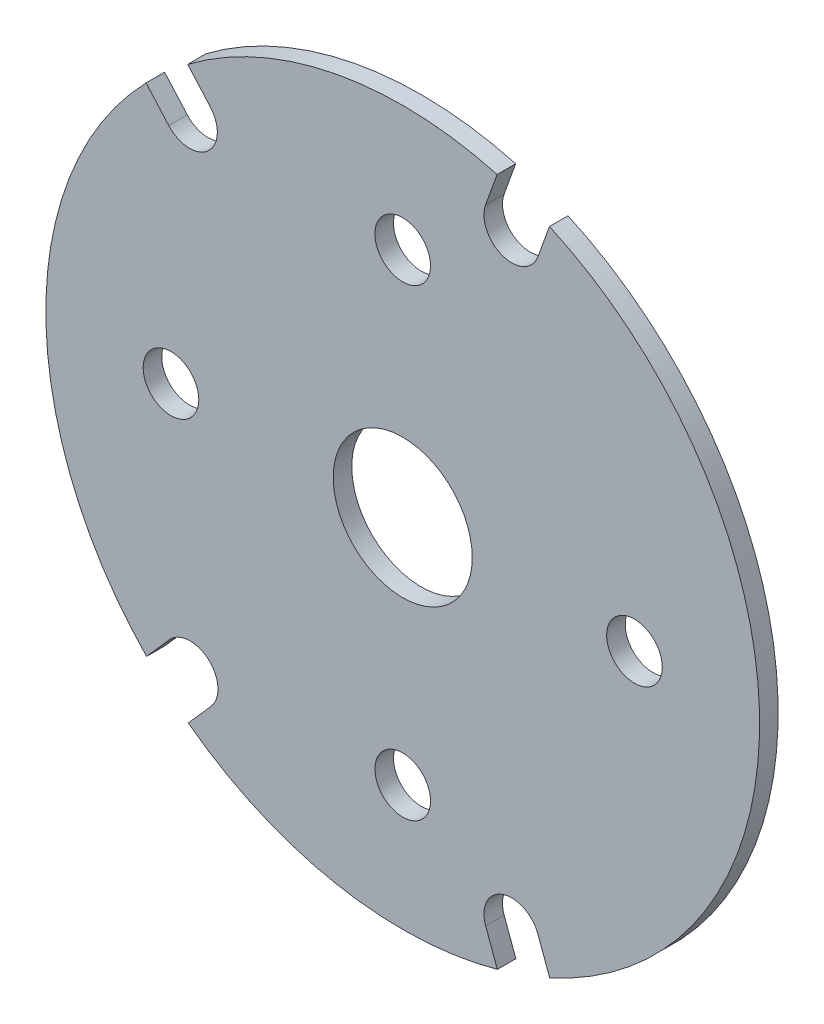
ISO-10303-21;
HEADER;
FILE_DESCRIPTION(('STEP AP214'),'2;1');
FILE_NAME('part.step','',(''),(''),'','','');
FILE_SCHEMA(('AUTOMOTIVE_DESIGN { 1 0 10303 214 1 1 1 1 }'));
ENDSEC;
DATA;
#1=APPLICATION_CONTEXT('core data for automotive mechanical design processes');
#2=APPLICATION_PROTOCOL_DEFINITION('international standard','automotive_design',2000,#1);
#3=PRODUCT_CONTEXT('',#1,'mechanical');
#4=PRODUCT('Part','Part','',(#3));
#5=PRODUCT_RELATED_PRODUCT_CATEGORY('part','',(#4));
#6=PRODUCT_DEFINITION_FORMATION('','',#4);
#7=PRODUCT_DEFINITION_CONTEXT('part definition',#1,'design');
#8=PRODUCT_DEFINITION('design','',#6,#7);
#9=PRODUCT_DEFINITION_SHAPE('','',#8);
#10=(LENGTH_UNIT() NAMED_UNIT(*) SI_UNIT(.MILLI.,.METRE.));
#11=(NAMED_UNIT(*) PLANE_ANGLE_UNIT() SI_UNIT($,.RADIAN.));
#12=(NAMED_UNIT(*) SI_UNIT($,.STERADIAN.) SOLID_ANGLE_UNIT());
#13=UNCERTAINTY_MEASURE_WITH_UNIT(LENGTH_MEASURE(1.E-05),#10,'distance_accuracy_value','');
#14=(GEOMETRIC_REPRESENTATION_CONTEXT(3) GLOBAL_UNCERTAINTY_ASSIGNED_CONTEXT((#13)) GLOBAL_UNIT_ASSIGNED_CONTEXT((#10,
#11,#12)) REPRESENTATION_CONTEXT('',''));
#15=CARTESIAN_POINT('',(0.,0.,0.));
#16=DIRECTION('',(0.,0.,1.));
#17=DIRECTION('',(1.,0.,0.));
#18=AXIS2_PLACEMENT_3D('',#15,#16,#17);
#19=CARTESIAN_POINT('',(0.,0.,2.));
#20=DIRECTION('',(0.,0.,-1.));
#21=DIRECTION('',(-1.,0.,0.));
#22=AXIS2_PLACEMENT_3D('',#19,#20,#21);
#23=PLANE('',#22);
#24=CARTESIAN_POINT('',(0.,-24.9999999999999,2.));
#25=DIRECTION('',(0.,0.,1.));
#26=DIRECTION('',(1.,0.,0.));
#27=AXIS2_PLACEMENT_3D('',#24,#25,#26);
#28=CIRCLE('',#27,3.00000000000011);
#29=CARTESIAN_POINT('',(3.00000000000011,-24.9999999999999,2.));
#30=VERTEX_POINT('',#29);
#31=EDGE_CURVE('E348',#30,#30,#28,.T.);
#32=ORIENTED_EDGE('',*,*,#31,.F.);
#33=EDGE_LOOP('',(#32));
#34=FACE_BOUND('',#33,.T.);
#35=CARTESIAN_POINT('',(0.,25.0000000000001,2.));
#36=DIRECTION('',(0.,0.,1.));
#37=DIRECTION('',(1.,0.,0.));
#38=AXIS2_PLACEMENT_3D('',#35,#36,#37);
#39=CIRCLE('',#38,3.00000000000011);
#40=CARTESIAN_POINT('',(3.00000000000011,25.0000000000001,2.));
#41=VERTEX_POINT('',#40);
#42=EDGE_CURVE('E360',#41,#41,#39,.T.);
#43=ORIENTED_EDGE('',*,*,#42,.F.);
#44=EDGE_LOOP('',(#43));
#45=FACE_BOUND('',#44,.T.);
#46=CARTESIAN_POINT('',(0.,0.,2.));
#47=DIRECTION('',(0.,0.,1.));
#48=DIRECTION('',(-1.,0.,0.));
#49=AXIS2_PLACEMENT_3D('',#46,#47,#48);
#50=CIRCLE('',#49,38.5000000000001);
#51=CARTESIAN_POINT('',(10.1824279789369,37.1290743279949,2.));
#52=VERTEX_POINT('',#51);
#53=CARTESIAN_POINT('',(-23.1958325761252,30.7278920705664,2.));
#54=VERTEX_POINT('',#53);
#55=EDGE_CURVE('E209',#52,#54,#50,.T.);
#56=ORIENTED_EDGE('',*,*,#55,.T.);
#57=DIRECTION('',(0.662848980359993,-0.748753116344579,0.));
#58=VECTOR('',#57,1.);
#59=CARTESIAN_POINT('',(-23.1958325761252,30.7278920705664,2.));
#60=LINE('',#59,#58);
#61=CARTESIAN_POINT('',(-20.7537406509652,27.9693090546125,2.));
#62=VERTEX_POINT('',#61);
#63=EDGE_CURVE('E117',#54,#62,#60,.T.);
#64=ORIENTED_EDGE('',*,*,#63,.T.);
#65=CARTESIAN_POINT('',(-22.999999999999,25.9807621135325,2.));
#66=DIRECTION('',(0.,0.,-1.));
#67=DIRECTION('',(1.,0.,0.));
#68=AXIS2_PLACEMENT_3D('',#65,#66,#67);
#69=CIRCLE('',#68,3.00000000000011);
#70=CARTESIAN_POINT('',(-25.2462593490335,23.9922151724532,2.));
#71=VERTEX_POINT('',#70);
#72=EDGE_CURVE('E248',#62,#71,#69,.T.);
#73=ORIENTED_EDGE('',*,*,#72,.T.);
#74=DIRECTION('',(-0.662848980359739,0.748753116344803,0.));
#75=VECTOR('',#74,1.);
#76=CARTESIAN_POINT('',(-27.6883512741925,26.7507981884079,2.));
#77=LINE('',#76,#75);
#78=CARTESIAN_POINT('',(-27.6883512741925,26.7507981884079,2.));
#79=VERTEX_POINT('',#78);
#80=EDGE_CURVE('E267',#71,#79,#77,.T.);
#81=ORIENTED_EDGE('',*,*,#80,.T.);
#82=CARTESIAN_POINT('',(0.,0.,2.));
#83=DIRECTION('',(0.,0.,1.));
#84=DIRECTION('',(1.,0.,0.));
#85=AXIS2_PLACEMENT_3D('',#82,#83,#84);
#86=CIRCLE('',#85,38.5000000000001);
#87=CARTESIAN_POINT('',(-27.6356502480301,-26.8052389537673,2.));
#88=VERTEX_POINT('',#87);
#89=EDGE_CURVE('E264',#79,#88,#86,.T.);
#90=ORIENTED_EDGE('',*,*,#89,.T.);
#91=DIRECTION('',(0.661374099223748,0.750056198478471,0.));
#92=VECTOR('',#91,1.);
#93=CARTESIAN_POINT('',(-27.6356502480301,-26.8052389537673,2.));
#94=LINE('',#93,#92);
#95=CARTESIAN_POINT('',(-25.1818791704052,-24.0224474767805,2.));
#96=VERTEX_POINT('',#95);
#97=EDGE_CURVE('E266',#88,#96,#94,.T.);
#98=ORIENTED_EDGE('',*,*,#97,.T.);
#99=CARTESIAN_POINT('',(-22.9317105749697,-26.0065697744518,2.));
#100=DIRECTION('',(0.,0.,-1.));
#101=DIRECTION('',(1.,0.,0.));
#102=AXIS2_PLACEMENT_3D('',#99,#100,#101);
#103=CIRCLE('',#102,3.00000000000011);
#104=CARTESIAN_POINT('',(-20.6815419795334,-27.9906920721221,2.));
#105=VERTEX_POINT('',#104);
#106=EDGE_CURVE('E269',#96,#105,#103,.T.);
#107=ORIENTED_EDGE('',*,*,#106,.T.);
#108=DIRECTION('',(-0.661374099223434,-0.750056198478749,0.));
#109=VECTOR('',#108,1.);
#110=CARTESIAN_POINT('',(-23.1353130571571,-30.77348354911,2.));
#111=LINE('',#110,#109);
#112=CARTESIAN_POINT('',(-23.1353130571571,-30.77348354911,2.));
#113=VERTEX_POINT('',#112);
#114=EDGE_CURVE('E275',#105,#113,#111,.T.);
#115=ORIENTED_EDGE('',*,*,#114,.T.);
#116=CARTESIAN_POINT('',(0.,0.,2.));
#117=DIRECTION('',(0.,0.,1.));
#118=DIRECTION('',(1.,0.,0.));
#119=AXIS2_PLACEMENT_3D('',#116,#117,#118);
#120=CIRCLE('',#119,38.5000000000001);
#121=CARTESIAN_POINT('',(10.2065672611284,-37.1224458346169,2.));
#122=VERTEX_POINT('',#121);
#123=EDGE_CURVE('E277',#113,#122,#120,.T.);
#124=ORIENTED_EDGE('',*,*,#123,.T.);
#125=DIRECTION('',(-0.345205371147535,0.938527171546404,0.));
#126=VECTOR('',#125,1.);
#127=CARTESIAN_POINT('',(8.94677793861724,-33.697393363184,2.));
#128=LINE('',#127,#126);
#129=CARTESIAN_POINT('',(8.94677793861724,-33.697393363184,2.));
#130=VERTEX_POINT('',#129);
#131=EDGE_CURVE('E279',#122,#130,#128,.T.);
#132=ORIENTED_EDGE('',*,*,#131,.T.);
#133=CARTESIAN_POINT('',(11.7623155639084,-32.6617933929489,2.));
#134=DIRECTION('',(0.,0.,-1.));
#135=DIRECTION('',(1.,0.,0.));
#136=AXIS2_PLACEMENT_3D('',#133,#134,#135);
#137=CIRCLE('',#136,2.99995323593236);
#138=CARTESIAN_POINT('',(14.5778531891995,-31.6261934227138,2.));
#139=VERTEX_POINT('',#138);
#140=EDGE_CURVE('E281',#130,#139,#137,.T.);
#141=ORIENTED_EDGE('',*,*,#140,.T.);
#142=DIRECTION('',(0.345205371147454,-0.938527171546434,0.));
#143=VECTOR('',#142,1.);
#144=CARTESIAN_POINT('',(14.5778531891995,-31.6261934227138,2.));
#145=LINE('',#144,#143);
#146=CARTESIAN_POINT('',(15.8503654511488,-35.0858363882784,2.));
#147=VERTEX_POINT('',#146);
#148=EDGE_CURVE('E283',#139,#147,#145,.T.);
#149=ORIENTED_EDGE('',*,*,#148,.T.);
#150=CARTESIAN_POINT('',(0.,0.,2.));
#151=DIRECTION('',(0.,0.,1.));
#152=DIRECTION('',(1.,0.,0.));
#153=AXIS2_PLACEMENT_3D('',#150,#151,#152);
#154=CIRCLE('',#153,38.5000000000001);
#155=CARTESIAN_POINT('',(15.8274456798914,35.0961816049851,2.));
#156=VERTEX_POINT('',#155);
#157=EDGE_CURVE('E160',#147,#156,#154,.T.);
#158=ORIENTED_EDGE('',*,*,#157,.T.);
#159=DIRECTION('',(-0.338820735357716,-0.940850949561968,0.));
#160=VECTOR('',#159,1.);
#161=CARTESIAN_POINT('',(14.5848244145768,31.6456212483918,2.));
#162=LINE('',#161,#160);
#163=CARTESIAN_POINT('',(14.5848244145768,31.6456212483918,2.));
#164=VERTEX_POINT('',#163);
#165=EDGE_CURVE('E154',#156,#164,#162,.T.);
#166=ORIENTED_EDGE('',*,*,#165,.T.);
#167=CARTESIAN_POINT('',(11.7623155639084,32.6620676098292,2.));
#168=DIRECTION('',(0.,0.,-1.));
#169=DIRECTION('',(1.,0.,0.));
#170=AXIS2_PLACEMENT_3D('',#167,#168,#169);
#171=CIRCLE('',#170,2.99995323593236);
#172=CARTESIAN_POINT('',(8.93980671332687,33.678513971508,2.));
#173=VERTEX_POINT('',#172);
#174=EDGE_CURVE('E158',#164,#173,#171,.T.);
#175=ORIENTED_EDGE('',*,*,#174,.T.);
#176=DIRECTION('',(0.338820735438274,0.940850949532957,0.));
#177=VECTOR('',#176,1.);
#178=CARTESIAN_POINT('',(8.93980671332687,33.678513971508,2.));
#179=LINE('',#178,#177);
#180=EDGE_CURVE('E50',#173,#52,#179,.T.);
#181=ORIENTED_EDGE('',*,*,#180,.T.);
#182=EDGE_LOOP('',(#56,#64,#73,#81,#90,#98,#107,#115,#124,#132,#141,#149,#158,#166,#175,#181));
#183=FACE_BOUND('',#182,.T.);
#184=CARTESIAN_POINT('',(0.,0.,2.));
#185=DIRECTION('',(0.,0.,1.));
#186=DIRECTION('',(1.,0.,0.));
#187=AXIS2_PLACEMENT_3D('',#184,#185,#186);
#188=CIRCLE('',#187,7.49999999999984);
#189=CARTESIAN_POINT('',(7.49999999999984,0.,2.));
#190=VERTEX_POINT('',#189);
#191=EDGE_CURVE('E182',#190,#190,#188,.T.);
#192=ORIENTED_EDGE('',*,*,#191,.F.);
#193=EDGE_LOOP('',(#192));
#194=FACE_BOUND('',#193,.T.);
#195=CARTESIAN_POINT('',(25.0000000000004,0.,2.));
#196=DIRECTION('',(0.,0.,1.));
#197=DIRECTION('',(1.,0.,0.));
#198=AXIS2_PLACEMENT_3D('',#195,#196,#197);
#199=CIRCLE('',#198,3.00000000000011);
#200=CARTESIAN_POINT('',(28.0000000000005,0.,2.));
#201=VERTEX_POINT('',#200);
#202=EDGE_CURVE('E354',#201,#201,#199,.T.);
#203=ORIENTED_EDGE('',*,*,#202,.F.);
#204=EDGE_LOOP('',(#203));
#205=FACE_BOUND('',#204,.T.);
#206=CARTESIAN_POINT('',(-24.9999999999999,-1.11022302462516E-13,2.));
#207=DIRECTION('',(0.,0.,1.));
#208=DIRECTION('',(1.,0.,0.));
#209=AXIS2_PLACEMENT_3D('',#206,#207,#208);
#210=CIRCLE('',#209,3.00000000000014);
#211=CARTESIAN_POINT('',(-21.9999999999998,-1.11022302462516E-13,2.));
#212=VERTEX_POINT('',#211);
#213=EDGE_CURVE('E339',#212,#212,#210,.T.);
#214=ORIENTED_EDGE('',*,*,#213,.F.);
#215=EDGE_LOOP('',(#214));
#216=FACE_BOUND('',#215,.T.);
#217=ADVANCED_FACE('F33',(#34,#45,#183,#194,#205,#216),#23,.F.);
#218=CARTESIAN_POINT('',(0.,0.,0.));
#219=DIRECTION('',(0.,0.,-1.));
#220=DIRECTION('',(-1.,0.,0.));
#221=AXIS2_PLACEMENT_3D('',#218,#219,#220);
#222=PLANE('',#221);
#223=CARTESIAN_POINT('',(0.,-24.9999999999999,0.));
#224=DIRECTION('',(0.,0.,1.));
#225=DIRECTION('',(1.,0.,0.));
#226=AXIS2_PLACEMENT_3D('',#223,#224,#225);
#227=CIRCLE('',#226,3.00000000000011);
#228=CARTESIAN_POINT('',(3.00000000000011,-24.9999999999999,0.));
#229=VERTEX_POINT('',#228);
#230=EDGE_CURVE('E345',#229,#229,#227,.T.);
#231=ORIENTED_EDGE('',*,*,#230,.T.);
#232=EDGE_LOOP('',(#231));
#233=FACE_BOUND('',#232,.T.);
#234=CARTESIAN_POINT('',(0.,25.0000000000001,0.));
#235=DIRECTION('',(0.,0.,1.));
#236=DIRECTION('',(1.,0.,0.));
#237=AXIS2_PLACEMENT_3D('',#234,#235,#236);
#238=CIRCLE('',#237,3.00000000000011);
#239=CARTESIAN_POINT('',(3.00000000000011,25.0000000000001,0.));
#240=VERTEX_POINT('',#239);
#241=EDGE_CURVE('E357',#240,#240,#238,.T.);
#242=ORIENTED_EDGE('',*,*,#241,.T.);
#243=EDGE_LOOP('',(#242));
#244=FACE_BOUND('',#243,.T.);
#245=CARTESIAN_POINT('',(0.,0.,0.));
#246=DIRECTION('',(0.,0.,1.));
#247=DIRECTION('',(-1.,0.,0.));
#248=AXIS2_PLACEMENT_3D('',#245,#246,#247);
#249=CIRCLE('',#248,38.5000000000001);
#250=CARTESIAN_POINT('',(10.1824279789369,37.1290743279949,0.));
#251=VERTEX_POINT('',#250);
#252=CARTESIAN_POINT('',(-23.1958325761252,30.7278920705664,0.));
#253=VERTEX_POINT('',#252);
#254=EDGE_CURVE('E178',#251,#253,#249,.T.);
#255=ORIENTED_EDGE('',*,*,#254,.F.);
#256=DIRECTION('',(0.338820735438274,0.940850949532957,0.));
#257=VECTOR('',#256,1.);
#258=CARTESIAN_POINT('',(8.93980671332687,33.678513971508,0.));
#259=LINE('',#258,#257);
#260=CARTESIAN_POINT('',(8.93980671332687,33.678513971508,0.));
#261=VERTEX_POINT('',#260);
#262=EDGE_CURVE('E109',#261,#251,#259,.T.);
#263=ORIENTED_EDGE('',*,*,#262,.F.);
#264=CARTESIAN_POINT('',(11.7623155639084,32.6620676098292,0.));
#265=DIRECTION('',(0.,0.,-1.));
#266=DIRECTION('',(1.,0.,0.));
#267=AXIS2_PLACEMENT_3D('',#264,#265,#266);
#268=CIRCLE('',#267,2.99995323593236);
#269=CARTESIAN_POINT('',(14.5848244145768,31.6456212483918,0.));
#270=VERTEX_POINT('',#269);
#271=EDGE_CURVE('E103',#270,#261,#268,.T.);
#272=ORIENTED_EDGE('',*,*,#271,.F.);
#273=DIRECTION('',(-0.338820735357716,-0.940850949561968,0.));
#274=VECTOR('',#273,1.);
#275=CARTESIAN_POINT('',(14.5848244145768,31.6456212483918,0.));
#276=LINE('',#275,#274);
#277=CARTESIAN_POINT('',(15.8274456798914,35.0961816049851,0.));
#278=VERTEX_POINT('',#277);
#279=EDGE_CURVE('E168',#278,#270,#276,.T.);
#280=ORIENTED_EDGE('',*,*,#279,.F.);
#281=CARTESIAN_POINT('',(0.,0.,0.));
#282=DIRECTION('',(0.,0.,1.));
#283=DIRECTION('',(1.,0.,0.));
#284=AXIS2_PLACEMENT_3D('',#281,#282,#283);
#285=CIRCLE('',#284,38.5000000000001);
#286=CARTESIAN_POINT('',(15.8503654511488,-35.0858363882784,0.));
#287=VERTEX_POINT('',#286);
#288=EDGE_CURVE('E204',#287,#278,#285,.T.);
#289=ORIENTED_EDGE('',*,*,#288,.F.);
#290=DIRECTION('',(0.345205371147454,-0.938527171546434,0.));
#291=VECTOR('',#290,1.);
#292=CARTESIAN_POINT('',(14.5778531891995,-31.6261934227138,0.));
#293=LINE('',#292,#291);
#294=CARTESIAN_POINT('',(14.5778531891995,-31.6261934227138,0.));
#295=VERTEX_POINT('',#294);
#296=EDGE_CURVE('E202',#295,#287,#293,.T.);
#297=ORIENTED_EDGE('',*,*,#296,.F.);
#298=CARTESIAN_POINT('',(11.7623155639084,-32.6617933929489,0.));
#299=DIRECTION('',(0.,0.,-1.));
#300=DIRECTION('',(1.,0.,0.));
#301=AXIS2_PLACEMENT_3D('',#298,#299,#300);
#302=CIRCLE('',#301,2.99995323593236);
#303=CARTESIAN_POINT('',(8.94677793861724,-33.697393363184,0.));
#304=VERTEX_POINT('',#303);
#305=EDGE_CURVE('E200',#304,#295,#302,.T.);
#306=ORIENTED_EDGE('',*,*,#305,.F.);
#307=DIRECTION('',(-0.345205371147535,0.938527171546404,0.));
#308=VECTOR('',#307,1.);
#309=CARTESIAN_POINT('',(8.94677793861724,-33.697393363184,0.));
#310=LINE('',#309,#308);
#311=CARTESIAN_POINT('',(10.2065672611284,-37.1224458346169,0.));
#312=VERTEX_POINT('',#311);
#313=EDGE_CURVE('E198',#312,#304,#310,.T.);
#314=ORIENTED_EDGE('',*,*,#313,.F.);
#315=CARTESIAN_POINT('',(0.,0.,0.));
#316=DIRECTION('',(0.,0.,1.));
#317=DIRECTION('',(1.,0.,0.));
#318=AXIS2_PLACEMENT_3D('',#315,#316,#317);
#319=CIRCLE('',#318,38.5000000000001);
#320=CARTESIAN_POINT('',(-23.1353130571571,-30.77348354911,0.));
#321=VERTEX_POINT('',#320);
#322=EDGE_CURVE('E196',#321,#312,#319,.T.);
#323=ORIENTED_EDGE('',*,*,#322,.F.);
#324=DIRECTION('',(-0.661374099223434,-0.750056198478749,0.));
#325=VECTOR('',#324,1.);
#326=CARTESIAN_POINT('',(-23.1353130571571,-30.77348354911,0.));
#327=LINE('',#326,#325);
#328=CARTESIAN_POINT('',(-20.6815419795334,-27.9906920721221,0.));
#329=VERTEX_POINT('',#328);
#330=EDGE_CURVE('E194',#329,#321,#327,.T.);
#331=ORIENTED_EDGE('',*,*,#330,.F.);
#332=CARTESIAN_POINT('',(-22.9317105749697,-26.0065697744518,0.));
#333=DIRECTION('',(0.,0.,-1.));
#334=DIRECTION('',(1.,0.,0.));
#335=AXIS2_PLACEMENT_3D('',#332,#333,#334);
#336=CIRCLE('',#335,3.00000000000011);
#337=CARTESIAN_POINT('',(-25.1818791704052,-24.0224474767805,0.));
#338=VERTEX_POINT('',#337);
#339=EDGE_CURVE('E192',#338,#329,#336,.T.);
#340=ORIENTED_EDGE('',*,*,#339,.F.);
#341=DIRECTION('',(0.661374099223748,0.750056198478471,0.));
#342=VECTOR('',#341,1.);
#343=CARTESIAN_POINT('',(-27.6356502480301,-26.8052389537673,0.));
#344=LINE('',#343,#342);
#345=CARTESIAN_POINT('',(-27.6356502480301,-26.8052389537673,0.));
#346=VERTEX_POINT('',#345);
#347=EDGE_CURVE('E190',#346,#338,#344,.T.);
#348=ORIENTED_EDGE('',*,*,#347,.F.);
#349=CARTESIAN_POINT('',(0.,0.,0.));
#350=DIRECTION('',(0.,0.,1.));
#351=DIRECTION('',(1.,0.,0.));
#352=AXIS2_PLACEMENT_3D('',#349,#350,#351);
#353=CIRCLE('',#352,38.5000000000001);
#354=CARTESIAN_POINT('',(-27.6883512741925,26.7507981884079,0.));
#355=VERTEX_POINT('',#354);
#356=EDGE_CURVE('E188',#355,#346,#353,.T.);
#357=ORIENTED_EDGE('',*,*,#356,.F.);
#358=DIRECTION('',(-0.662848980359739,0.748753116344803,0.));
#359=VECTOR('',#358,1.);
#360=CARTESIAN_POINT('',(-27.6883512741925,26.7507981884079,0.));
#361=LINE('',#360,#359);
#362=CARTESIAN_POINT('',(-25.2462593490335,23.9922151724532,0.));
#363=VERTEX_POINT('',#362);
#364=EDGE_CURVE('E186',#363,#355,#361,.T.);
#365=ORIENTED_EDGE('',*,*,#364,.F.);
#366=CARTESIAN_POINT('',(-22.999999999999,25.9807621135325,0.));
#367=DIRECTION('',(0.,0.,-1.));
#368=DIRECTION('',(1.,0.,0.));
#369=AXIS2_PLACEMENT_3D('',#366,#367,#368);
#370=CIRCLE('',#369,3.00000000000011);
#371=CARTESIAN_POINT('',(-20.7537406509652,27.9693090546125,0.));
#372=VERTEX_POINT('',#371);
#373=EDGE_CURVE('E184',#372,#363,#370,.T.);
#374=ORIENTED_EDGE('',*,*,#373,.F.);
#375=DIRECTION('',(0.662848980359993,-0.748753116344579,0.));
#376=VECTOR('',#375,1.);
#377=CARTESIAN_POINT('',(-23.1958325761252,30.7278920705664,0.));
#378=LINE('',#377,#376);
#379=EDGE_CURVE('E181',#253,#372,#378,.T.);
#380=ORIENTED_EDGE('',*,*,#379,.F.);
#381=EDGE_LOOP('',(#255,#263,#272,#280,#289,#297,#306,#314,#323,#331,#340,#348,#357,#365,#374,#380));
#382=FACE_BOUND('',#381,.T.);
#383=CARTESIAN_POINT('',(0.,0.,0.));
#384=DIRECTION('',(0.,0.,1.));
#385=DIRECTION('',(1.,0.,0.));
#386=AXIS2_PLACEMENT_3D('',#383,#384,#385);
#387=CIRCLE('',#386,7.49999999999984);
#388=CARTESIAN_POINT('',(7.49999999999984,0.,0.));
#389=VERTEX_POINT('',#388);
#390=EDGE_CURVE('E363',#389,#389,#387,.T.);
#391=ORIENTED_EDGE('',*,*,#390,.T.);
#392=EDGE_LOOP('',(#391));
#393=FACE_BOUND('',#392,.T.);
#394=CARTESIAN_POINT('',(25.0000000000004,0.,0.));
#395=DIRECTION('',(0.,0.,1.));
#396=DIRECTION('',(1.,0.,0.));
#397=AXIS2_PLACEMENT_3D('',#394,#395,#396);
#398=CIRCLE('',#397,3.00000000000011);
#399=CARTESIAN_POINT('',(28.0000000000005,0.,0.));
#400=VERTEX_POINT('',#399);
#401=EDGE_CURVE('E351',#400,#400,#398,.T.);
#402=ORIENTED_EDGE('',*,*,#401,.T.);
#403=EDGE_LOOP('',(#402));
#404=FACE_BOUND('',#403,.T.);
#405=CARTESIAN_POINT('',(-24.9999999999999,-1.11022302462516E-13,0.));
#406=DIRECTION('',(0.,0.,1.));
#407=DIRECTION('',(1.,0.,0.));
#408=AXIS2_PLACEMENT_3D('',#405,#406,#407);
#409=CIRCLE('',#408,3.00000000000014);
#410=CARTESIAN_POINT('',(-21.9999999999998,-1.11022302462516E-13,0.));
#411=VERTEX_POINT('',#410);
#412=EDGE_CURVE('E342',#411,#411,#409,.T.);
#413=ORIENTED_EDGE('',*,*,#412,.T.);
#414=EDGE_LOOP('',(#413));
#415=FACE_BOUND('',#414,.T.);
#416=ADVANCED_FACE('F252',(#233,#244,#382,#393,#404,#415),#222,.T.);
#417=CARTESIAN_POINT('',(0.,0.,2.));
#418=DIRECTION('',(0.,0.,-1.));
#419=DIRECTION('',(-1.,0.,0.));
#420=AXIS2_PLACEMENT_3D('',#417,#418,#419);
#421=CYLINDRICAL_SURFACE('',#420,38.5000000000001);
#422=ORIENTED_EDGE('',*,*,#254,.T.);
#423=DIRECTION('',(0.,0.,-1.));
#424=VECTOR('',#423,1.);
#425=CARTESIAN_POINT('',(-23.1958325761252,30.7278920705664,2.));
#426=LINE('',#425,#424);
#427=EDGE_CURVE('E11',#54,#253,#426,.T.);
#428=ORIENTED_EDGE('',*,*,#427,.F.);
#429=ORIENTED_EDGE('',*,*,#55,.F.);
#430=DIRECTION('',(0.,0.,-1.));
#431=VECTOR('',#430,1.);
#432=CARTESIAN_POINT('',(10.1824279789369,37.1290743279949,2.));
#433=LINE('',#432,#431);
#434=EDGE_CURVE('E174',#52,#251,#433,.T.);
#435=ORIENTED_EDGE('',*,*,#434,.T.);
#436=EDGE_LOOP('',(#422,#428,#429,#435));
#437=FACE_BOUND('',#436,.T.);
#438=ADVANCED_FACE('F35',(#437),#421,.T.);
#439=CARTESIAN_POINT('',(-23.1958325761252,30.7278920705664,2.));
#440=DIRECTION('',(0.748753116344579,0.662848980359993,0.));
#441=DIRECTION('',(-0.662848980359993,0.748753116344579,0.));
#442=AXIS2_PLACEMENT_3D('',#439,#440,#441);
#443=PLANE('',#442);
#444=ORIENTED_EDGE('',*,*,#379,.T.);
#445=DIRECTION('',(0.,0.,-1.));
#446=VECTOR('',#445,1.);
#447=CARTESIAN_POINT('',(-20.7537406509652,27.9693090546125,2.));
#448=LINE('',#447,#446);
#449=EDGE_CURVE('E42',#62,#372,#448,.T.);
#450=ORIENTED_EDGE('',*,*,#449,.F.);
#451=ORIENTED_EDGE('',*,*,#63,.F.);
#452=ORIENTED_EDGE('',*,*,#427,.T.);
#453=EDGE_LOOP('',(#444,#450,#451,#452));
#454=FACE_BOUND('',#453,.T.);
#455=ADVANCED_FACE('F521',(#454),#443,.F.);
#456=CARTESIAN_POINT('',(-22.999999999999,25.9807621135325,2.));
#457=DIRECTION('',(0.,0.,-1.));
#458=DIRECTION('',(-1.,0.,0.));
#459=AXIS2_PLACEMENT_3D('',#456,#457,#458);
#460=CYLINDRICAL_SURFACE('',#459,3.00000000000011);
#461=ORIENTED_EDGE('',*,*,#373,.T.);
#462=DIRECTION('',(0.,0.,-1.));
#463=VECTOR('',#462,1.);
#464=CARTESIAN_POINT('',(-25.2462593490335,23.9922151724532,2.));
#465=LINE('',#464,#463);
#466=EDGE_CURVE('E240',#71,#363,#465,.T.);
#467=ORIENTED_EDGE('',*,*,#466,.F.);
#468=ORIENTED_EDGE('',*,*,#72,.F.);
#469=ORIENTED_EDGE('',*,*,#449,.T.);
#470=EDGE_LOOP('',(#461,#467,#468,#469));
#471=FACE_BOUND('',#470,.T.);
#472=ADVANCED_FACE('F246',(#471),#460,.F.);
#473=CARTESIAN_POINT('',(-27.6883512741925,26.7507981884079,2.));
#474=DIRECTION('',(-0.748753116344803,-0.662848980359739,0.));
#475=DIRECTION('',(0.662848980359739,-0.748753116344803,0.));
#476=AXIS2_PLACEMENT_3D('',#473,#474,#475);
#477=PLANE('',#476);
#478=ORIENTED_EDGE('',*,*,#364,.T.);
#479=DIRECTION('',(0.,0.,-1.));
#480=VECTOR('',#479,1.);
#481=CARTESIAN_POINT('',(-27.6883512741925,26.7507981884079,2.));
#482=LINE('',#481,#480);
#483=EDGE_CURVE('E237',#79,#355,#482,.T.);
#484=ORIENTED_EDGE('',*,*,#483,.F.);
#485=ORIENTED_EDGE('',*,*,#80,.F.);
#486=ORIENTED_EDGE('',*,*,#466,.T.);
#487=EDGE_LOOP('',(#478,#484,#485,#486));
#488=FACE_BOUND('',#487,.T.);
#489=ADVANCED_FACE('F258',(#488),#477,.F.);
#490=CARTESIAN_POINT('',(0.,0.,2.));
#491=DIRECTION('',(0.,0.,-1.));
#492=DIRECTION('',(-1.,0.,0.));
#493=AXIS2_PLACEMENT_3D('',#490,#491,#492);
#494=CYLINDRICAL_SURFACE('',#493,38.5000000000001);
#495=ORIENTED_EDGE('',*,*,#356,.T.);
#496=DIRECTION('',(0.,0.,-1.));
#497=VECTOR('',#496,1.);
#498=CARTESIAN_POINT('',(-27.6356502480301,-26.8052389537673,2.));
#499=LINE('',#498,#497);
#500=EDGE_CURVE('E234',#88,#346,#499,.T.);
#501=ORIENTED_EDGE('',*,*,#500,.F.);
#502=ORIENTED_EDGE('',*,*,#89,.F.);
#503=ORIENTED_EDGE('',*,*,#483,.T.);
#504=EDGE_LOOP('',(#495,#501,#502,#503));
#505=FACE_BOUND('',#504,.T.);
#506=ADVANCED_FACE('F262',(#505),#494,.T.);
#507=CARTESIAN_POINT('',(-27.6356502480301,-26.8052389537673,2.));
#508=DIRECTION('',(-0.750056198478471,0.661374099223749,0.));
#509=DIRECTION('',(-0.661374099223749,-0.750056198478471,0.));
#510=AXIS2_PLACEMENT_3D('',#507,#508,#509);
#511=PLANE('',#510);
#512=ORIENTED_EDGE('',*,*,#347,.T.);
#513=DIRECTION('',(0.,0.,-1.));
#514=VECTOR('',#513,1.);
#515=CARTESIAN_POINT('',(-25.1818791704052,-24.0224474767805,2.));
#516=LINE('',#515,#514);
#517=EDGE_CURVE('E231',#96,#338,#516,.T.);
#518=ORIENTED_EDGE('',*,*,#517,.F.);
#519=ORIENTED_EDGE('',*,*,#97,.F.);
#520=ORIENTED_EDGE('',*,*,#500,.T.);
#521=EDGE_LOOP('',(#512,#518,#519,#520));
#522=FACE_BOUND('',#521,.T.);
#523=ADVANCED_FACE('F486',(#522),#511,.F.);
#524=CARTESIAN_POINT('',(-22.9317105749697,-26.0065697744518,2.));
#525=DIRECTION('',(0.,0.,-1.));
#526=DIRECTION('',(-1.,0.,0.));
#527=AXIS2_PLACEMENT_3D('',#524,#525,#526);
#528=CYLINDRICAL_SURFACE('',#527,3.00000000000011);
#529=ORIENTED_EDGE('',*,*,#339,.T.);
#530=DIRECTION('',(0.,0.,-1.));
#531=VECTOR('',#530,1.);
#532=CARTESIAN_POINT('',(-20.6815419795334,-27.9906920721221,2.));
#533=LINE('',#532,#531);
#534=EDGE_CURVE('E228',#105,#329,#533,.T.);
#535=ORIENTED_EDGE('',*,*,#534,.F.);
#536=ORIENTED_EDGE('',*,*,#106,.F.);
#537=ORIENTED_EDGE('',*,*,#517,.T.);
#538=EDGE_LOOP('',(#529,#535,#536,#537));
#539=FACE_BOUND('',#538,.T.);
#540=ADVANCED_FACE('F476',(#539),#528,.F.);
#541=CARTESIAN_POINT('',(-23.1353130571571,-30.77348354911,2.));
#542=DIRECTION('',(0.750056198478749,-0.661374099223433,0.));
#543=DIRECTION('',(0.661374099223433,0.750056198478749,0.));
#544=AXIS2_PLACEMENT_3D('',#541,#542,#543);
#545=PLANE('',#544);
#546=ORIENTED_EDGE('',*,*,#330,.T.);
#547=DIRECTION('',(0.,0.,-1.));
#548=VECTOR('',#547,1.);
#549=CARTESIAN_POINT('',(-23.1353130571571,-30.77348354911,2.));
#550=LINE('',#549,#548);
#551=EDGE_CURVE('E225',#113,#321,#550,.T.);
#552=ORIENTED_EDGE('',*,*,#551,.F.);
#553=ORIENTED_EDGE('',*,*,#114,.F.);
#554=ORIENTED_EDGE('',*,*,#534,.T.);
#555=EDGE_LOOP('',(#546,#552,#553,#554));
#556=FACE_BOUND('',#555,.T.);
#557=ADVANCED_FACE('F466',(#556),#545,.F.);
#558=CARTESIAN_POINT('',(0.,0.,2.));
#559=DIRECTION('',(0.,0.,-1.));
#560=DIRECTION('',(-1.,0.,0.));
#561=AXIS2_PLACEMENT_3D('',#558,#559,#560);
#562=CYLINDRICAL_SURFACE('',#561,38.5000000000001);
#563=ORIENTED_EDGE('',*,*,#322,.T.);
#564=DIRECTION('',(0.,0.,-1.));
#565=VECTOR('',#564,1.);
#566=CARTESIAN_POINT('',(10.2065672611284,-37.1224458346169,2.));
#567=LINE('',#566,#565);
#568=EDGE_CURVE('E222',#122,#312,#567,.T.);
#569=ORIENTED_EDGE('',*,*,#568,.F.);
#570=ORIENTED_EDGE('',*,*,#123,.F.);
#571=ORIENTED_EDGE('',*,*,#551,.T.);
#572=EDGE_LOOP('',(#563,#569,#570,#571));
#573=FACE_BOUND('',#572,.T.);
#574=ADVANCED_FACE('F456',(#573),#562,.T.);
#575=CARTESIAN_POINT('',(8.94677793861724,-33.697393363184,2.));
#576=DIRECTION('',(-0.938527171546404,-0.345205371147535,0.));
#577=DIRECTION('',(0.345205371147535,-0.938527171546404,0.));
#578=AXIS2_PLACEMENT_3D('',#575,#576,#577);
#579=PLANE('',#578);
#580=ORIENTED_EDGE('',*,*,#313,.T.);
#581=DIRECTION('',(0.,0.,-1.));
#582=VECTOR('',#581,1.);
#583=CARTESIAN_POINT('',(8.94677793861724,-33.697393363184,2.));
#584=LINE('',#583,#582);
#585=EDGE_CURVE('E219',#130,#304,#584,.T.);
#586=ORIENTED_EDGE('',*,*,#585,.F.);
#587=ORIENTED_EDGE('',*,*,#131,.F.);
#588=ORIENTED_EDGE('',*,*,#568,.T.);
#589=EDGE_LOOP('',(#580,#586,#587,#588));
#590=FACE_BOUND('',#589,.T.);
#591=ADVANCED_FACE('F446',(#590),#579,.F.);
#592=CARTESIAN_POINT('',(11.7623155639084,-32.6617933929489,2.));
#593=DIRECTION('',(0.,0.,-1.));
#594=DIRECTION('',(-1.,0.,0.));
#595=AXIS2_PLACEMENT_3D('',#592,#593,#594);
#596=CYLINDRICAL_SURFACE('',#595,2.99995323593236);
#597=ORIENTED_EDGE('',*,*,#305,.T.);
#598=DIRECTION('',(0.,0.,-1.));
#599=VECTOR('',#598,1.);
#600=CARTESIAN_POINT('',(14.5778531891995,-31.6261934227138,2.));
#601=LINE('',#600,#599);
#602=EDGE_CURVE('E216',#139,#295,#601,.T.);
#603=ORIENTED_EDGE('',*,*,#602,.F.);
#604=ORIENTED_EDGE('',*,*,#140,.F.);
#605=ORIENTED_EDGE('',*,*,#585,.T.);
#606=EDGE_LOOP('',(#597,#603,#604,#605));
#607=FACE_BOUND('',#606,.T.);
#608=ADVANCED_FACE('F437',(#607),#596,.F.);
#609=CARTESIAN_POINT('',(14.5778531891995,-31.6261934227138,2.));
#610=DIRECTION('',(0.938527171546434,0.345205371147454,0.));
#611=DIRECTION('',(-0.345205371147454,0.938527171546434,0.));
#612=AXIS2_PLACEMENT_3D('',#609,#610,#611);
#613=PLANE('',#612);
#614=ORIENTED_EDGE('',*,*,#296,.T.);
#615=DIRECTION('',(0.,0.,-1.));
#616=VECTOR('',#615,1.);
#617=CARTESIAN_POINT('',(15.8503654511488,-35.0858363882784,2.));
#618=LINE('',#617,#616);
#619=EDGE_CURVE('E213',#147,#287,#618,.T.);
#620=ORIENTED_EDGE('',*,*,#619,.F.);
#621=ORIENTED_EDGE('',*,*,#148,.F.);
#622=ORIENTED_EDGE('',*,*,#602,.T.);
#623=EDGE_LOOP('',(#614,#620,#621,#622));
#624=FACE_BOUND('',#623,.T.);
#625=ADVANCED_FACE('F289',(#624),#613,.F.);
#626=CARTESIAN_POINT('',(0.,0.,2.));
#627=DIRECTION('',(0.,0.,-1.));
#628=DIRECTION('',(-1.,0.,0.));
#629=AXIS2_PLACEMENT_3D('',#626,#627,#628);
#630=CYLINDRICAL_SURFACE('',#629,38.5000000000001);
#631=ORIENTED_EDGE('',*,*,#288,.T.);
#632=DIRECTION('',(0.,0.,-1.));
#633=VECTOR('',#632,1.);
#634=CARTESIAN_POINT('',(15.8274456798914,35.0961816049851,2.));
#635=LINE('',#634,#633);
#636=EDGE_CURVE('E169',#156,#278,#635,.T.);
#637=ORIENTED_EDGE('',*,*,#636,.F.);
#638=ORIENTED_EDGE('',*,*,#157,.F.);
#639=ORIENTED_EDGE('',*,*,#619,.T.);
#640=EDGE_LOOP('',(#631,#637,#638,#639));
#641=FACE_BOUND('',#640,.T.);
#642=ADVANCED_FACE('F293',(#641),#630,.T.);
#643=CARTESIAN_POINT('',(14.5848244145768,31.6456212483918,2.));
#644=DIRECTION('',(0.940850949561968,-0.338820735357716,0.));
#645=DIRECTION('',(0.338820735357716,0.940850949561968,0.));
#646=AXIS2_PLACEMENT_3D('',#643,#644,#645);
#647=PLANE('',#646);
#648=ORIENTED_EDGE('',*,*,#279,.T.);
#649=DIRECTION('',(0.,0.,-1.));
#650=VECTOR('',#649,1.);
#651=CARTESIAN_POINT('',(14.5848244145768,31.6456212483918,2.));
#652=LINE('',#651,#650);
#653=EDGE_CURVE('E165',#164,#270,#652,.T.);
#654=ORIENTED_EDGE('',*,*,#653,.F.);
#655=ORIENTED_EDGE('',*,*,#165,.F.);
#656=ORIENTED_EDGE('',*,*,#636,.T.);
#657=EDGE_LOOP('',(#648,#654,#655,#656));
#658=FACE_BOUND('',#657,.T.);
#659=ADVANCED_FACE('F166',(#658),#647,.F.);
#660=CARTESIAN_POINT('',(11.7623155639084,32.6620676098292,2.));
#661=DIRECTION('',(0.,0.,-1.));
#662=DIRECTION('',(-1.,0.,0.));
#663=AXIS2_PLACEMENT_3D('',#660,#661,#662);
#664=CYLINDRICAL_SURFACE('',#663,2.99995323593236);
#665=ORIENTED_EDGE('',*,*,#271,.T.);
#666=DIRECTION('',(0.,0.,-1.));
#667=VECTOR('',#666,1.);
#668=CARTESIAN_POINT('',(8.93980671332687,33.678513971508,2.));
#669=LINE('',#668,#667);
#670=EDGE_CURVE('E170',#173,#261,#669,.T.);
#671=ORIENTED_EDGE('',*,*,#670,.F.);
#672=ORIENTED_EDGE('',*,*,#174,.F.);
#673=ORIENTED_EDGE('',*,*,#653,.T.);
#674=EDGE_LOOP('',(#665,#671,#672,#673));
#675=FACE_BOUND('',#674,.T.);
#676=ADVANCED_FACE('F172',(#675),#664,.F.);
#677=CARTESIAN_POINT('',(8.93980671332687,33.678513971508,2.));
#678=DIRECTION('',(-0.940850949532957,0.338820735438274,0.));
#679=DIRECTION('',(-0.338820735438274,-0.940850949532957,0.));
#680=AXIS2_PLACEMENT_3D('',#677,#678,#679);
#681=PLANE('',#680);
#682=ORIENTED_EDGE('',*,*,#262,.T.);
#683=ORIENTED_EDGE('',*,*,#434,.F.);
#684=ORIENTED_EDGE('',*,*,#180,.F.);
#685=ORIENTED_EDGE('',*,*,#670,.T.);
#686=EDGE_LOOP('',(#682,#683,#684,#685));
#687=FACE_BOUND('',#686,.T.);
#688=ADVANCED_FACE('F297',(#687),#681,.F.);
#689=CARTESIAN_POINT('',(0.,0.,2.));
#690=DIRECTION('',(0.,0.,-1.));
#691=DIRECTION('',(-1.,0.,0.));
#692=AXIS2_PLACEMENT_3D('',#689,#690,#691);
#693=CYLINDRICAL_SURFACE('',#692,7.49999999999984);
#694=ORIENTED_EDGE('',*,*,#191,.T.);
#695=EDGE_LOOP('',(#694));
#696=FACE_BOUND('',#695,.T.);
#697=ORIENTED_EDGE('',*,*,#390,.F.);
#698=EDGE_LOOP('',(#697));
#699=FACE_BOUND('',#698,.T.);
#700=ADVANCED_FACE('F299',(#696,#699),#693,.F.);
#701=CARTESIAN_POINT('',(0.,25.0000000000001,2.));
#702=DIRECTION('',(0.,0.,-1.));
#703=DIRECTION('',(-1.,0.,0.));
#704=AXIS2_PLACEMENT_3D('',#701,#702,#703);
#705=CYLINDRICAL_SURFACE('',#704,3.00000000000011);
#706=ORIENTED_EDGE('',*,*,#42,.T.);
#707=EDGE_LOOP('',(#706));
#708=FACE_BOUND('',#707,.T.);
#709=ORIENTED_EDGE('',*,*,#241,.F.);
#710=EDGE_LOOP('',(#709));
#711=FACE_BOUND('',#710,.T.);
#712=ADVANCED_FACE('F305',(#708,#711),#705,.F.);
#713=CARTESIAN_POINT('',(25.0000000000004,0.,2.));
#714=DIRECTION('',(0.,0.,-1.));
#715=DIRECTION('',(-1.,0.,0.));
#716=AXIS2_PLACEMENT_3D('',#713,#714,#715);
#717=CYLINDRICAL_SURFACE('',#716,3.00000000000011);
#718=ORIENTED_EDGE('',*,*,#202,.T.);
#719=EDGE_LOOP('',(#718));
#720=FACE_BOUND('',#719,.T.);
#721=ORIENTED_EDGE('',*,*,#401,.F.);
#722=EDGE_LOOP('',(#721));
#723=FACE_BOUND('',#722,.T.);
#724=ADVANCED_FACE('F322',(#720,#723),#717,.F.);
#725=CARTESIAN_POINT('',(0.,-24.9999999999999,2.));
#726=DIRECTION('',(0.,0.,-1.));
#727=DIRECTION('',(-1.,0.,0.));
#728=AXIS2_PLACEMENT_3D('',#725,#726,#727);
#729=CYLINDRICAL_SURFACE('',#728,3.00000000000011);
#730=ORIENTED_EDGE('',*,*,#31,.T.);
#731=EDGE_LOOP('',(#730));
#732=FACE_BOUND('',#731,.T.);
#733=ORIENTED_EDGE('',*,*,#230,.F.);
#734=EDGE_LOOP('',(#733));
#735=FACE_BOUND('',#734,.T.);
#736=ADVANCED_FACE('F326',(#732,#735),#729,.F.);
#737=CARTESIAN_POINT('',(-24.9999999999999,-1.11022302462516E-13,2.));
#738=DIRECTION('',(0.,0.,-1.));
#739=DIRECTION('',(-1.,0.,0.));
#740=AXIS2_PLACEMENT_3D('',#737,#738,#739);
#741=CYLINDRICAL_SURFACE('',#740,3.00000000000014);
#742=ORIENTED_EDGE('',*,*,#213,.T.);
#743=EDGE_LOOP('',(#742));
#744=FACE_BOUND('',#743,.T.);
#745=ORIENTED_EDGE('',*,*,#412,.F.);
#746=EDGE_LOOP('',(#745));
#747=FACE_BOUND('',#746,.T.);
#748=ADVANCED_FACE('F330',(#744,#747),#741,.F.);
#749=CLOSED_SHELL('',(#217,#416,#438,#455,#472,#489,#506,#523,#540,#557,#574,#591,#608,#625,
#642,#659,#676,#688,#700,#712,#724,#736,#748));
#750=MANIFOLD_SOLID_BREP('B2',#749);
#751=ADVANCED_BREP_SHAPE_REPRESENTATION('',(#18,#750),#14);
#752=SHAPE_DEFINITION_REPRESENTATION(#9,#751);
ENDSEC;
END-ISO-10303-21;
